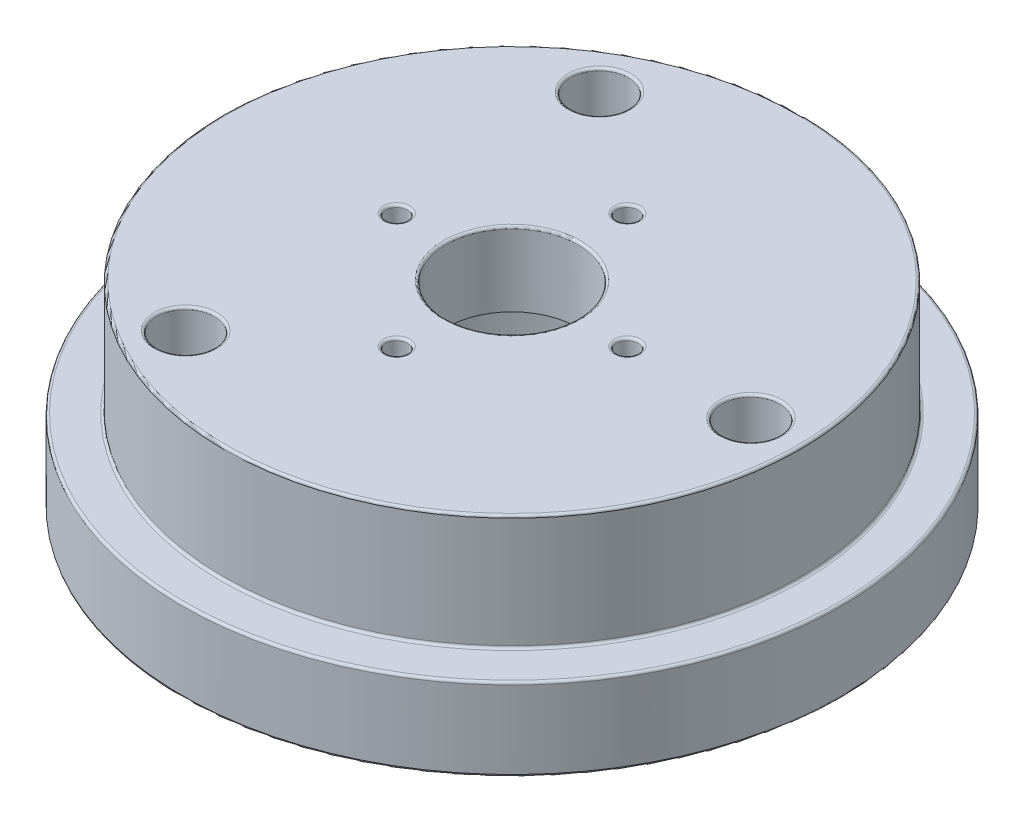
ISO-10303-21;
HEADER;
FILE_DESCRIPTION(('STEP AP214'),'2;1');
FILE_NAME('part.step','',(''),(''),'','','');
FILE_SCHEMA(('AUTOMOTIVE_DESIGN { 1 0 10303 214 1 1 1 1 }'));
ENDSEC;
DATA;
#1=APPLICATION_CONTEXT('core data for automotive mechanical design processes');
#2=APPLICATION_PROTOCOL_DEFINITION('international standard','automotive_design',2000,#1);
#3=PRODUCT_CONTEXT('',#1,'mechanical');
#4=PRODUCT('Part','Part','',(#3));
#5=PRODUCT_RELATED_PRODUCT_CATEGORY('part','',(#4));
#6=PRODUCT_DEFINITION_FORMATION('','',#4);
#7=PRODUCT_DEFINITION_CONTEXT('part definition',#1,'design');
#8=PRODUCT_DEFINITION('design','',#6,#7);
#9=PRODUCT_DEFINITION_SHAPE('','',#8);
#10=(LENGTH_UNIT() NAMED_UNIT(*) SI_UNIT(.MILLI.,.METRE.));
#11=(NAMED_UNIT(*) PLANE_ANGLE_UNIT() SI_UNIT($,.RADIAN.));
#12=(NAMED_UNIT(*) SI_UNIT($,.STERADIAN.) SOLID_ANGLE_UNIT());
#13=UNCERTAINTY_MEASURE_WITH_UNIT(LENGTH_MEASURE(1.E-05),#10,'distance_accuracy_value','');
#14=(GEOMETRIC_REPRESENTATION_CONTEXT(3) GLOBAL_UNCERTAINTY_ASSIGNED_CONTEXT((#13)) GLOBAL_UNIT_ASSIGNED_CONTEXT((#10,
#11,#12)) REPRESENTATION_CONTEXT('',''));
#15=CARTESIAN_POINT('',(0.,0.,0.));
#16=DIRECTION('',(0.,0.,1.));
#17=DIRECTION('',(1.,0.,0.));
#18=AXIS2_PLACEMENT_3D('',#15,#16,#17);
#19=CARTESIAN_POINT('',(-7.,12.,0.));
#20=DIRECTION('',(0.,-1.,0.));
#21=DIRECTION('',(1.,0.,0.));
#22=AXIS2_PLACEMENT_3D('',#19,#20,#21);
#23=CYLINDRICAL_SURFACE('',#22,0.65);
#24=CARTESIAN_POINT('',(-7.,11.85,0.));
#25=DIRECTION('',(0.,1.,0.));
#26=DIRECTION('',(-1.,0.,0.));
#27=AXIS2_PLACEMENT_3D('',#24,#25,#26);
#28=CIRCLE('',#27,0.65);
#29=CARTESIAN_POINT('',(-7.65,11.85,0.));
#30=VERTEX_POINT('',#29);
#31=EDGE_CURVE('E61',#30,#30,#28,.T.);
#32=ORIENTED_EDGE('',*,*,#31,.T.);
#33=EDGE_LOOP('',(#32));
#34=FACE_BOUND('',#33,.T.);
#35=CARTESIAN_POINT('',(-7.,7.5,0.));
#36=DIRECTION('',(0.,-1.,0.));
#37=DIRECTION('',(1.,0.,0.));
#38=AXIS2_PLACEMENT_3D('',#35,#36,#37);
#39=CIRCLE('',#38,0.65);
#40=CARTESIAN_POINT('',(-6.35,7.5,0.));
#41=VERTEX_POINT('',#40);
#42=EDGE_CURVE('E189',#41,#41,#39,.T.);
#43=ORIENTED_EDGE('',*,*,#42,.T.);
#44=EDGE_LOOP('',(#43));
#45=FACE_BOUND('',#44,.T.);
#46=ADVANCED_FACE('F37',(#34,#45),#23,.F.);
#47=CARTESIAN_POINT('',(7.,12.,0.));
#48=DIRECTION('',(0.,-1.,0.));
#49=DIRECTION('',(1.,0.,0.));
#50=AXIS2_PLACEMENT_3D('',#47,#48,#49);
#51=CYLINDRICAL_SURFACE('',#50,0.65);
#52=CARTESIAN_POINT('',(7.,11.85,0.));
#53=DIRECTION('',(0.,1.,0.));
#54=DIRECTION('',(-1.,0.,0.));
#55=AXIS2_PLACEMENT_3D('',#52,#53,#54);
#56=CIRCLE('',#55,0.65);
#57=CARTESIAN_POINT('',(6.35,11.85,0.));
#58=VERTEX_POINT('',#57);
#59=EDGE_CURVE('E55',#58,#58,#56,.T.);
#60=ORIENTED_EDGE('',*,*,#59,.T.);
#61=EDGE_LOOP('',(#60));
#62=FACE_BOUND('',#61,.T.);
#63=CARTESIAN_POINT('',(7.,7.5,0.));
#64=DIRECTION('',(0.,-1.,0.));
#65=DIRECTION('',(1.,0.,0.));
#66=AXIS2_PLACEMENT_3D('',#63,#64,#65);
#67=CIRCLE('',#66,0.65);
#68=CARTESIAN_POINT('',(7.65,7.5,0.));
#69=VERTEX_POINT('',#68);
#70=EDGE_CURVE('E181',#69,#69,#67,.T.);
#71=ORIENTED_EDGE('',*,*,#70,.T.);
#72=EDGE_LOOP('',(#71));
#73=FACE_BOUND('',#72,.T.);
#74=ADVANCED_FACE('F227',(#62,#73),#51,.F.);
#75=CARTESIAN_POINT('',(0.,12.,7.));
#76=DIRECTION('',(0.,-1.,0.));
#77=DIRECTION('',(1.,0.,0.));
#78=AXIS2_PLACEMENT_3D('',#75,#76,#77);
#79=CYLINDRICAL_SURFACE('',#78,0.65);
#80=CARTESIAN_POINT('',(0.,11.85,7.));
#81=DIRECTION('',(0.,1.,0.));
#82=DIRECTION('',(-1.,0.,0.));
#83=AXIS2_PLACEMENT_3D('',#80,#81,#82);
#84=CIRCLE('',#83,0.65);
#85=CARTESIAN_POINT('',(-0.650000000000002,11.85,7.));
#86=VERTEX_POINT('',#85);
#87=EDGE_CURVE('E50',#86,#86,#84,.T.);
#88=ORIENTED_EDGE('',*,*,#87,.T.);
#89=EDGE_LOOP('',(#88));
#90=FACE_BOUND('',#89,.T.);
#91=CARTESIAN_POINT('',(0.,7.5,7.));
#92=DIRECTION('',(0.,-1.,0.));
#93=DIRECTION('',(1.,0.,0.));
#94=AXIS2_PLACEMENT_3D('',#91,#92,#93);
#95=CIRCLE('',#94,0.65);
#96=CARTESIAN_POINT('',(0.649999999999998,7.5,7.));
#97=VERTEX_POINT('',#96);
#98=EDGE_CURVE('E193',#97,#97,#95,.T.);
#99=ORIENTED_EDGE('',*,*,#98,.T.);
#100=EDGE_LOOP('',(#99));
#101=FACE_BOUND('',#100,.T.);
#102=ADVANCED_FACE('F198',(#90,#101),#79,.F.);
#103=CARTESIAN_POINT('',(0.,12.,-7.));
#104=DIRECTION('',(0.,-1.,0.));
#105=DIRECTION('',(1.,0.,0.));
#106=AXIS2_PLACEMENT_3D('',#103,#104,#105);
#107=CYLINDRICAL_SURFACE('',#106,0.65);
#108=CARTESIAN_POINT('',(0.,11.85,-7.));
#109=DIRECTION('',(0.,1.,0.));
#110=DIRECTION('',(-1.,0.,0.));
#111=AXIS2_PLACEMENT_3D('',#108,#109,#110);
#112=CIRCLE('',#111,0.65);
#113=CARTESIAN_POINT('',(-0.649999999999999,11.85,-7.));
#114=VERTEX_POINT('',#113);
#115=EDGE_CURVE('E45',#114,#114,#112,.T.);
#116=ORIENTED_EDGE('',*,*,#115,.T.);
#117=EDGE_LOOP('',(#116));
#118=FACE_BOUND('',#117,.T.);
#119=CARTESIAN_POINT('',(0.,7.5,-7.));
#120=DIRECTION('',(0.,-1.,0.));
#121=DIRECTION('',(1.,0.,0.));
#122=AXIS2_PLACEMENT_3D('',#119,#120,#121);
#123=CIRCLE('',#122,0.65);
#124=CARTESIAN_POINT('',(0.650000000000001,7.5,-7.));
#125=VERTEX_POINT('',#124);
#126=EDGE_CURVE('E185',#125,#125,#123,.T.);
#127=ORIENTED_EDGE('',*,*,#126,.T.);
#128=EDGE_LOOP('',(#127));
#129=FACE_BOUND('',#128,.T.);
#130=ADVANCED_FACE('F238',(#118,#129),#107,.F.);
#131=CARTESIAN_POINT('',(0.,12.,0.));
#132=DIRECTION('',(0.,-1.,0.));
#133=DIRECTION('',(1.,0.,0.));
#134=AXIS2_PLACEMENT_3D('',#131,#132,#133);
#135=CYLINDRICAL_SURFACE('',#134,4.);
#136=CARTESIAN_POINT('',(0.,11.85,0.));
#137=DIRECTION('',(0.,1.,0.));
#138=DIRECTION('',(-1.,0.,0.));
#139=AXIS2_PLACEMENT_3D('',#136,#137,#138);
#140=CIRCLE('',#139,4.);
#141=CARTESIAN_POINT('',(-4.,11.85,0.));
#142=VERTEX_POINT('',#141);
#143=EDGE_CURVE('E10',#142,#142,#140,.T.);
#144=ORIENTED_EDGE('',*,*,#143,.T.);
#145=EDGE_LOOP('',(#144));
#146=FACE_BOUND('',#145,.T.);
#147=CARTESIAN_POINT('',(0.,7.5,0.));
#148=DIRECTION('',(0.,-1.,0.));
#149=DIRECTION('',(1.,0.,0.));
#150=AXIS2_PLACEMENT_3D('',#147,#148,#149);
#151=CIRCLE('',#150,4.);
#152=CARTESIAN_POINT('',(4.,7.5,0.));
#153=VERTEX_POINT('',#152);
#154=EDGE_CURVE('E177',#153,#153,#151,.T.);
#155=ORIENTED_EDGE('',*,*,#154,.T.);
#156=EDGE_LOOP('',(#155));
#157=FACE_BOUND('',#156,.T.);
#158=ADVANCED_FACE('F241',(#146,#157),#135,.F.);
#159=CARTESIAN_POINT('',(0.,0.,0.));
#160=DIRECTION('',(0.,-1.,0.));
#161=DIRECTION('',(1.,0.,0.));
#162=AXIS2_PLACEMENT_3D('',#159,#160,#161);
#163=PLANE('',#162);
#164=CARTESIAN_POINT('',(0.,0.,0.));
#165=DIRECTION('',(0.,-1.,0.));
#166=DIRECTION('',(1.,0.,0.));
#167=AXIS2_PLACEMENT_3D('',#164,#165,#166);
#168=CIRCLE('',#167,19.85);
#169=CARTESIAN_POINT('',(19.85,0.,0.));
#170=VERTEX_POINT('',#169);
#171=EDGE_CURVE('E145',#170,#170,#168,.T.);
#172=ORIENTED_EDGE('',*,*,#171,.T.);
#173=EDGE_LOOP('',(#172));
#174=FACE_BOUND('',#173,.T.);
#175=CARTESIAN_POINT('',(-7.24999999999999,0.,-12.5573683548744));
#176=DIRECTION('',(0.,-1.,0.));
#177=DIRECTION('',(1.,0.,0.));
#178=AXIS2_PLACEMENT_3D('',#175,#176,#177);
#179=CIRCLE('',#178,1.89999999999998);
#180=CARTESIAN_POINT('',(-5.35000000000002,0.,-12.5573683548744));
#181=VERTEX_POINT('',#180);
#182=EDGE_CURVE('E149',#181,#181,#179,.F.);
#183=ORIENTED_EDGE('',*,*,#182,.T.);
#184=EDGE_LOOP('',(#183));
#185=FACE_BOUND('',#184,.T.);
#186=CARTESIAN_POINT('',(14.5,0.,0.));
#187=DIRECTION('',(0.,-1.,0.));
#188=DIRECTION('',(1.,0.,0.));
#189=AXIS2_PLACEMENT_3D('',#186,#187,#188);
#190=CIRCLE('',#189,1.9);
#191=CARTESIAN_POINT('',(16.4,0.,0.));
#192=VERTEX_POINT('',#191);
#193=EDGE_CURVE('E153',#192,#192,#190,.F.);
#194=ORIENTED_EDGE('',*,*,#193,.T.);
#195=EDGE_LOOP('',(#194));
#196=FACE_BOUND('',#195,.T.);
#197=CARTESIAN_POINT('',(-7.25,0.,12.5573683548744));
#198=DIRECTION('',(0.,-1.,0.));
#199=DIRECTION('',(1.,0.,0.));
#200=AXIS2_PLACEMENT_3D('',#197,#198,#199);
#201=CIRCLE('',#200,1.89999999999996);
#202=CARTESIAN_POINT('',(-5.35000000000004,0.,12.5573683548744));
#203=VERTEX_POINT('',#202);
#204=EDGE_CURVE('E157',#203,#203,#201,.F.);
#205=ORIENTED_EDGE('',*,*,#204,.T.);
#206=EDGE_LOOP('',(#205));
#207=FACE_BOUND('',#206,.T.);
#208=CARTESIAN_POINT('',(0.,0.,0.));
#209=DIRECTION('',(0.,-1.,0.));
#210=DIRECTION('',(1.,0.,0.));
#211=AXIS2_PLACEMENT_3D('',#208,#209,#210);
#212=CIRCLE('',#211,10.15);
#213=CARTESIAN_POINT('',(10.15,0.,0.));
#214=VERTEX_POINT('',#213);
#215=EDGE_CURVE('E161',#214,#214,#212,.F.);
#216=ORIENTED_EDGE('',*,*,#215,.T.);
#217=EDGE_LOOP('',(#216));
#218=FACE_BOUND('',#217,.T.);
#219=ADVANCED_FACE('F261',(#174,#185,#196,#207,#218),#163,.T.);
#220=CARTESIAN_POINT('',(0.,12.,0.));
#221=DIRECTION('',(0.,1.,0.));
#222=DIRECTION('',(-1.,0.,0.));
#223=AXIS2_PLACEMENT_3D('',#220,#221,#222);
#224=CYLINDRICAL_SURFACE('',#223,20.);
#225=CARTESIAN_POINT('',(0.,0.149999999999999,0.));
#226=DIRECTION('',(0.,-1.,0.));
#227=DIRECTION('',(1.,0.,0.));
#228=AXIS2_PLACEMENT_3D('',#225,#226,#227);
#229=CIRCLE('',#228,20.);
#230=CARTESIAN_POINT('',(20.,0.149999999999999,0.));
#231=VERTEX_POINT('',#230);
#232=EDGE_CURVE('E165',#231,#231,#229,.F.);
#233=ORIENTED_EDGE('',*,*,#232,.T.);
#234=EDGE_LOOP('',(#233));
#235=FACE_BOUND('',#234,.T.);
#236=CARTESIAN_POINT('',(0.,4.85,0.));
#237=DIRECTION('',(0.,1.,0.));
#238=DIRECTION('',(-1.,0.,0.));
#239=AXIS2_PLACEMENT_3D('',#236,#237,#238);
#240=CIRCLE('',#239,20.);
#241=CARTESIAN_POINT('',(-20.,4.85,0.));
#242=VERTEX_POINT('',#241);
#243=EDGE_CURVE('E169',#242,#242,#240,.F.);
#244=ORIENTED_EDGE('',*,*,#243,.T.);
#245=EDGE_LOOP('',(#244));
#246=FACE_BOUND('',#245,.T.);
#247=ADVANCED_FACE('F257',(#235,#246),#224,.T.);
#248=CARTESIAN_POINT('',(-20.,5.,0.));
#249=DIRECTION('',(0.,1.,0.));
#250=DIRECTION('',(-1.,0.,0.));
#251=AXIS2_PLACEMENT_3D('',#248,#249,#250);
#252=PLANE('',#251);
#253=CARTESIAN_POINT('',(0.,5.,0.));
#254=DIRECTION('',(0.,1.,0.));
#255=DIRECTION('',(-1.,0.,0.));
#256=AXIS2_PLACEMENT_3D('',#253,#254,#255);
#257=CIRCLE('',#256,17.65);
#258=CARTESIAN_POINT('',(-17.65,5.,0.));
#259=VERTEX_POINT('',#258);
#260=EDGE_CURVE('E101',#259,#259,#257,.F.);
#261=ORIENTED_EDGE('',*,*,#260,.T.);
#262=EDGE_LOOP('',(#261));
#263=FACE_BOUND('',#262,.T.);
#264=CARTESIAN_POINT('',(0.,5.,0.));
#265=DIRECTION('',(0.,1.,0.));
#266=DIRECTION('',(-1.,0.,0.));
#267=AXIS2_PLACEMENT_3D('',#264,#265,#266);
#268=CIRCLE('',#267,19.85);
#269=CARTESIAN_POINT('',(-19.85,5.,0.));
#270=VERTEX_POINT('',#269);
#271=EDGE_CURVE('E105',#270,#270,#268,.T.);
#272=ORIENTED_EDGE('',*,*,#271,.T.);
#273=EDGE_LOOP('',(#272));
#274=FACE_BOUND('',#273,.T.);
#275=ADVANCED_FACE('F253',(#263,#274),#252,.T.);
#276=CARTESIAN_POINT('',(0.,12.,0.));
#277=DIRECTION('',(0.,1.,0.));
#278=DIRECTION('',(-1.,0.,0.));
#279=AXIS2_PLACEMENT_3D('',#276,#277,#278);
#280=CYLINDRICAL_SURFACE('',#279,17.5);
#281=CARTESIAN_POINT('',(0.,5.15,0.));
#282=DIRECTION('',(0.,1.,0.));
#283=DIRECTION('',(-1.,0.,0.));
#284=AXIS2_PLACEMENT_3D('',#281,#282,#283);
#285=CIRCLE('',#284,17.5);
#286=CARTESIAN_POINT('',(-17.5,5.15,0.));
#287=VERTEX_POINT('',#286);
#288=EDGE_CURVE('E109',#287,#287,#285,.T.);
#289=ORIENTED_EDGE('',*,*,#288,.T.);
#290=EDGE_LOOP('',(#289));
#291=FACE_BOUND('',#290,.T.);
#292=CARTESIAN_POINT('',(0.,11.85,0.));
#293=DIRECTION('',(0.,1.,0.));
#294=DIRECTION('',(-1.,0.,0.));
#295=AXIS2_PLACEMENT_3D('',#292,#293,#294);
#296=CIRCLE('',#295,17.5);
#297=CARTESIAN_POINT('',(-17.5,11.85,0.));
#298=VERTEX_POINT('',#297);
#299=EDGE_CURVE('E113',#298,#298,#296,.F.);
#300=ORIENTED_EDGE('',*,*,#299,.T.);
#301=EDGE_LOOP('',(#300));
#302=FACE_BOUND('',#301,.T.);
#303=ADVANCED_FACE('F249',(#291,#302),#280,.T.);
#304=CARTESIAN_POINT('',(-17.5,12.,0.));
#305=DIRECTION('',(0.,1.,0.));
#306=DIRECTION('',(-1.,0.,0.));
#307=AXIS2_PLACEMENT_3D('',#304,#305,#306);
#308=PLANE('',#307);
#309=CARTESIAN_POINT('',(0.,12.,0.));
#310=DIRECTION('',(0.,1.,0.));
#311=DIRECTION('',(-1.,0.,0.));
#312=AXIS2_PLACEMENT_3D('',#309,#310,#311);
#313=CIRCLE('',#312,17.35);
#314=CARTESIAN_POINT('',(-17.35,12.,0.));
#315=VERTEX_POINT('',#314);
#316=EDGE_CURVE('E65',#315,#315,#313,.T.);
#317=ORIENTED_EDGE('',*,*,#316,.T.);
#318=EDGE_LOOP('',(#317));
#319=FACE_BOUND('',#318,.T.);
#320=CARTESIAN_POINT('',(-7.,12.,0.));
#321=DIRECTION('',(0.,1.,0.));
#322=DIRECTION('',(-1.,0.,0.));
#323=AXIS2_PLACEMENT_3D('',#320,#321,#322);
#324=CIRCLE('',#323,0.8);
#325=CARTESIAN_POINT('',(-7.8,12.,0.));
#326=VERTEX_POINT('',#325);
#327=EDGE_CURVE('E69',#326,#326,#324,.F.);
#328=ORIENTED_EDGE('',*,*,#327,.T.);
#329=EDGE_LOOP('',(#328));
#330=FACE_BOUND('',#329,.T.);
#331=CARTESIAN_POINT('',(7.,12.,0.));
#332=DIRECTION('',(0.,1.,0.));
#333=DIRECTION('',(-1.,0.,0.));
#334=AXIS2_PLACEMENT_3D('',#331,#332,#333);
#335=CIRCLE('',#334,0.8);
#336=CARTESIAN_POINT('',(6.2,12.,0.));
#337=VERTEX_POINT('',#336);
#338=EDGE_CURVE('E73',#337,#337,#335,.F.);
#339=ORIENTED_EDGE('',*,*,#338,.T.);
#340=EDGE_LOOP('',(#339));
#341=FACE_BOUND('',#340,.T.);
#342=CARTESIAN_POINT('',(0.,12.,7.));
#343=DIRECTION('',(0.,1.,0.));
#344=DIRECTION('',(-1.,0.,0.));
#345=AXIS2_PLACEMENT_3D('',#342,#343,#344);
#346=CIRCLE('',#345,0.8);
#347=CARTESIAN_POINT('',(-0.800000000000002,12.,7.));
#348=VERTEX_POINT('',#347);
#349=EDGE_CURVE('E77',#348,#348,#346,.F.);
#350=ORIENTED_EDGE('',*,*,#349,.T.);
#351=EDGE_LOOP('',(#350));
#352=FACE_BOUND('',#351,.T.);
#353=CARTESIAN_POINT('',(0.,12.,-7.));
#354=DIRECTION('',(0.,1.,0.));
#355=DIRECTION('',(-1.,0.,0.));
#356=AXIS2_PLACEMENT_3D('',#353,#354,#355);
#357=CIRCLE('',#356,0.8);
#358=CARTESIAN_POINT('',(-0.799999999999999,12.,-7.));
#359=VERTEX_POINT('',#358);
#360=EDGE_CURVE('E81',#359,#359,#357,.F.);
#361=ORIENTED_EDGE('',*,*,#360,.T.);
#362=EDGE_LOOP('',(#361));
#363=FACE_BOUND('',#362,.T.);
#364=CARTESIAN_POINT('',(0.,12.,0.));
#365=DIRECTION('',(0.,1.,0.));
#366=DIRECTION('',(-1.,0.,0.));
#367=AXIS2_PLACEMENT_3D('',#364,#365,#366);
#368=CIRCLE('',#367,4.15);
#369=CARTESIAN_POINT('',(-4.15,12.,0.));
#370=VERTEX_POINT('',#369);
#371=EDGE_CURVE('E85',#370,#370,#368,.F.);
#372=ORIENTED_EDGE('',*,*,#371,.T.);
#373=EDGE_LOOP('',(#372));
#374=FACE_BOUND('',#373,.T.);
#375=CARTESIAN_POINT('',(-7.24999999999999,12.,-12.5573683548744));
#376=DIRECTION('',(0.,1.,0.));
#377=DIRECTION('',(-1.,0.,0.));
#378=AXIS2_PLACEMENT_3D('',#375,#376,#377);
#379=CIRCLE('',#378,1.89999999999998);
#380=CARTESIAN_POINT('',(-9.14999999999997,12.,-12.5573683548744));
#381=VERTEX_POINT('',#380);
#382=EDGE_CURVE('E89',#381,#381,#379,.F.);
#383=ORIENTED_EDGE('',*,*,#382,.T.);
#384=EDGE_LOOP('',(#383));
#385=FACE_BOUND('',#384,.T.);
#386=CARTESIAN_POINT('',(14.5,12.,0.));
#387=DIRECTION('',(0.,1.,0.));
#388=DIRECTION('',(-1.,0.,0.));
#389=AXIS2_PLACEMENT_3D('',#386,#387,#388);
#390=CIRCLE('',#389,1.9);
#391=CARTESIAN_POINT('',(12.6,12.,0.));
#392=VERTEX_POINT('',#391);
#393=EDGE_CURVE('E93',#392,#392,#390,.F.);
#394=ORIENTED_EDGE('',*,*,#393,.T.);
#395=EDGE_LOOP('',(#394));
#396=FACE_BOUND('',#395,.T.);
#397=CARTESIAN_POINT('',(-7.25,12.,12.5573683548744));
#398=DIRECTION('',(0.,1.,0.));
#399=DIRECTION('',(-1.,0.,0.));
#400=AXIS2_PLACEMENT_3D('',#397,#398,#399);
#401=CIRCLE('',#400,1.89999999999996);
#402=CARTESIAN_POINT('',(-9.14999999999996,12.,12.5573683548744));
#403=VERTEX_POINT('',#402);
#404=EDGE_CURVE('E97',#403,#403,#401,.F.);
#405=ORIENTED_EDGE('',*,*,#404,.T.);
#406=EDGE_LOOP('',(#405));
#407=FACE_BOUND('',#406,.T.);
#408=ADVANCED_FACE('F245',(#319,#330,#341,#352,#363,#374,#385,#396,#407),#308,.T.);
#409=CARTESIAN_POINT('',(-7.24999999999999,12.,-12.5573683548744));
#410=DIRECTION('',(0.,-1.,0.));
#411=DIRECTION('',(1.,0.,0.));
#412=AXIS2_PLACEMENT_3D('',#409,#410,#411);
#413=CYLINDRICAL_SURFACE('',#412,1.74999999999998);
#414=CARTESIAN_POINT('',(-7.24999999999999,0.149999999999999,-12.5573683548744));
#415=DIRECTION('',(0.,-1.,0.));
#416=DIRECTION('',(1.,0.,0.));
#417=AXIS2_PLACEMENT_3D('',#414,#415,#416);
#418=CIRCLE('',#417,1.74999999999998);
#419=CARTESIAN_POINT('',(-5.50000000000002,0.149999999999999,-12.5573683548744));
#420=VERTEX_POINT('',#419);
#421=EDGE_CURVE('E137',#420,#420,#418,.T.);
#422=ORIENTED_EDGE('',*,*,#421,.T.);
#423=EDGE_LOOP('',(#422));
#424=FACE_BOUND('',#423,.T.);
#425=CARTESIAN_POINT('',(-7.24999999999999,11.85,-12.5573683548744));
#426=DIRECTION('',(0.,1.,0.));
#427=DIRECTION('',(-1.,0.,0.));
#428=AXIS2_PLACEMENT_3D('',#425,#426,#427);
#429=CIRCLE('',#428,1.74999999999998);
#430=CARTESIAN_POINT('',(-8.99999999999997,11.85,-12.5573683548744));
#431=VERTEX_POINT('',#430);
#432=EDGE_CURVE('E141',#431,#431,#429,.T.);
#433=ORIENTED_EDGE('',*,*,#432,.T.);
#434=EDGE_LOOP('',(#433));
#435=FACE_BOUND('',#434,.T.);
#436=ADVANCED_FACE('F248',(#424,#435),#413,.F.);
#437=CARTESIAN_POINT('',(14.5,12.,0.));
#438=DIRECTION('',(0.,-1.,0.));
#439=DIRECTION('',(1.,0.,0.));
#440=AXIS2_PLACEMENT_3D('',#437,#438,#439);
#441=CYLINDRICAL_SURFACE('',#440,1.75);
#442=CARTESIAN_POINT('',(14.5,0.149999999999999,0.));
#443=DIRECTION('',(0.,-1.,0.));
#444=DIRECTION('',(1.,0.,0.));
#445=AXIS2_PLACEMENT_3D('',#442,#443,#444);
#446=CIRCLE('',#445,1.75);
#447=CARTESIAN_POINT('',(16.25,0.149999999999999,0.));
#448=VERTEX_POINT('',#447);
#449=EDGE_CURVE('E129',#448,#448,#446,.T.);
#450=ORIENTED_EDGE('',*,*,#449,.T.);
#451=EDGE_LOOP('',(#450));
#452=FACE_BOUND('',#451,.T.);
#453=CARTESIAN_POINT('',(14.5,11.85,0.));
#454=DIRECTION('',(0.,1.,0.));
#455=DIRECTION('',(-1.,0.,0.));
#456=AXIS2_PLACEMENT_3D('',#453,#454,#455);
#457=CIRCLE('',#456,1.75);
#458=CARTESIAN_POINT('',(12.75,11.85,0.));
#459=VERTEX_POINT('',#458);
#460=EDGE_CURVE('E133',#459,#459,#457,.T.);
#461=ORIENTED_EDGE('',*,*,#460,.T.);
#462=EDGE_LOOP('',(#461));
#463=FACE_BOUND('',#462,.T.);
#464=ADVANCED_FACE('F223',(#452,#463),#441,.F.);
#465=CARTESIAN_POINT('',(-7.25,12.,12.5573683548744));
#466=DIRECTION('',(0.,-1.,0.));
#467=DIRECTION('',(1.,0.,0.));
#468=AXIS2_PLACEMENT_3D('',#465,#466,#467);
#469=CYLINDRICAL_SURFACE('',#468,1.74999999999996);
#470=CARTESIAN_POINT('',(-7.25,0.149999999999999,12.5573683548744));
#471=DIRECTION('',(0.,-1.,0.));
#472=DIRECTION('',(1.,0.,0.));
#473=AXIS2_PLACEMENT_3D('',#470,#471,#472);
#474=CIRCLE('',#473,1.74999999999996);
#475=CARTESIAN_POINT('',(-5.50000000000004,0.149999999999999,12.5573683548744));
#476=VERTEX_POINT('',#475);
#477=EDGE_CURVE('E121',#476,#476,#474,.T.);
#478=ORIENTED_EDGE('',*,*,#477,.T.);
#479=EDGE_LOOP('',(#478));
#480=FACE_BOUND('',#479,.T.);
#481=CARTESIAN_POINT('',(-7.25,11.85,12.5573683548744));
#482=DIRECTION('',(0.,1.,0.));
#483=DIRECTION('',(-1.,0.,0.));
#484=AXIS2_PLACEMENT_3D('',#481,#482,#483);
#485=CIRCLE('',#484,1.74999999999996);
#486=CARTESIAN_POINT('',(-8.99999999999996,11.85,12.5573683548744));
#487=VERTEX_POINT('',#486);
#488=EDGE_CURVE('E125',#487,#487,#485,.T.);
#489=ORIENTED_EDGE('',*,*,#488,.T.);
#490=EDGE_LOOP('',(#489));
#491=FACE_BOUND('',#490,.T.);
#492=ADVANCED_FACE('F217',(#480,#491),#469,.F.);
#493=CARTESIAN_POINT('',(0.,7.5,0.));
#494=DIRECTION('',(0.,-1.,0.));
#495=DIRECTION('',(1.,0.,0.));
#496=AXIS2_PLACEMENT_3D('',#493,#494,#495);
#497=CYLINDRICAL_SURFACE('',#496,10.);
#498=CARTESIAN_POINT('',(0.,0.15,0.));
#499=DIRECTION('',(0.,-1.,0.));
#500=DIRECTION('',(1.,0.,0.));
#501=AXIS2_PLACEMENT_3D('',#498,#499,#500);
#502=CIRCLE('',#501,10.);
#503=CARTESIAN_POINT('',(10.,0.15,0.));
#504=VERTEX_POINT('',#503);
#505=EDGE_CURVE('E117',#504,#504,#502,.T.);
#506=ORIENTED_EDGE('',*,*,#505,.T.);
#507=EDGE_LOOP('',(#506));
#508=FACE_BOUND('',#507,.T.);
#509=CARTESIAN_POINT('',(0.,7.5,0.));
#510=DIRECTION('',(0.,-1.,0.));
#511=DIRECTION('',(1.,0.,0.));
#512=AXIS2_PLACEMENT_3D('',#509,#510,#511);
#513=CIRCLE('',#512,10.);
#514=CARTESIAN_POINT('',(10.,7.5,0.));
#515=VERTEX_POINT('',#514);
#516=EDGE_CURVE('E173',#515,#515,#513,.T.);
#517=ORIENTED_EDGE('',*,*,#516,.F.);
#518=EDGE_LOOP('',(#517));
#519=FACE_BOUND('',#518,.T.);
#520=ADVANCED_FACE('F204',(#508,#519),#497,.F.);
#521=CARTESIAN_POINT('',(0.,7.5,0.));
#522=DIRECTION('',(0.,-1.,0.));
#523=DIRECTION('',(1.,0.,0.));
#524=AXIS2_PLACEMENT_3D('',#521,#522,#523);
#525=PLANE('',#524);
#526=ORIENTED_EDGE('',*,*,#98,.F.);
#527=EDGE_LOOP('',(#526));
#528=FACE_BOUND('',#527,.T.);
#529=ORIENTED_EDGE('',*,*,#42,.F.);
#530=EDGE_LOOP('',(#529));
#531=FACE_BOUND('',#530,.T.);
#532=ORIENTED_EDGE('',*,*,#126,.F.);
#533=EDGE_LOOP('',(#532));
#534=FACE_BOUND('',#533,.T.);
#535=ORIENTED_EDGE('',*,*,#70,.F.);
#536=EDGE_LOOP('',(#535));
#537=FACE_BOUND('',#536,.T.);
#538=ORIENTED_EDGE('',*,*,#154,.F.);
#539=EDGE_LOOP('',(#538));
#540=FACE_BOUND('',#539,.T.);
#541=ORIENTED_EDGE('',*,*,#516,.T.);
#542=EDGE_LOOP('',(#541));
#543=FACE_BOUND('',#542,.T.);
#544=ADVANCED_FACE('F200',(#528,#531,#534,#537,#540,#543),#525,.T.);
#545=CARTESIAN_POINT('',(0.,0.149999999999999,0.));
#546=DIRECTION('',(0.,-1.,0.));
#547=DIRECTION('',(1.,0.,0.));
#548=AXIS2_PLACEMENT_3D('',#545,#546,#547);
#549=TOROIDAL_SURFACE('',#548,19.85,0.15);
#550=ORIENTED_EDGE('',*,*,#171,.F.);
#551=EDGE_LOOP('',(#550));
#552=FACE_BOUND('',#551,.T.);
#553=ORIENTED_EDGE('',*,*,#232,.F.);
#554=EDGE_LOOP('',(#553));
#555=FACE_BOUND('',#554,.T.);
#556=ADVANCED_FACE('F203',(#552,#555),#549,.T.);
#557=CARTESIAN_POINT('',(-7.24999999999999,0.149999999999999,-12.5573683548744));
#558=DIRECTION('',(0.,-1.,0.));
#559=DIRECTION('',(1.,0.,0.));
#560=AXIS2_PLACEMENT_3D('',#557,#558,#559);
#561=TOROIDAL_SURFACE('',#560,1.89999999999998,0.15);
#562=ORIENTED_EDGE('',*,*,#182,.F.);
#563=EDGE_LOOP('',(#562));
#564=FACE_BOUND('',#563,.T.);
#565=ORIENTED_EDGE('',*,*,#421,.F.);
#566=EDGE_LOOP('',(#565));
#567=FACE_BOUND('',#566,.T.);
#568=ADVANCED_FACE('F268',(#564,#567),#561,.T.);
#569=CARTESIAN_POINT('',(14.5,0.149999999999999,0.));
#570=DIRECTION('',(0.,-1.,0.));
#571=DIRECTION('',(1.,0.,0.));
#572=AXIS2_PLACEMENT_3D('',#569,#570,#571);
#573=TOROIDAL_SURFACE('',#572,1.9,0.15);
#574=ORIENTED_EDGE('',*,*,#193,.F.);
#575=EDGE_LOOP('',(#574));
#576=FACE_BOUND('',#575,.T.);
#577=ORIENTED_EDGE('',*,*,#449,.F.);
#578=EDGE_LOOP('',(#577));
#579=FACE_BOUND('',#578,.T.);
#580=ADVANCED_FACE('F272',(#576,#579),#573,.T.);
#581=CARTESIAN_POINT('',(-7.25,0.149999999999999,12.5573683548744));
#582=DIRECTION('',(0.,-1.,0.));
#583=DIRECTION('',(1.,0.,0.));
#584=AXIS2_PLACEMENT_3D('',#581,#582,#583);
#585=TOROIDAL_SURFACE('',#584,1.89999999999996,0.15);
#586=ORIENTED_EDGE('',*,*,#204,.F.);
#587=EDGE_LOOP('',(#586));
#588=FACE_BOUND('',#587,.T.);
#589=ORIENTED_EDGE('',*,*,#477,.F.);
#590=EDGE_LOOP('',(#589));
#591=FACE_BOUND('',#590,.T.);
#592=ADVANCED_FACE('F276',(#588,#591),#585,.T.);
#593=CARTESIAN_POINT('',(0.,0.15,0.));
#594=DIRECTION('',(0.,-1.,0.));
#595=DIRECTION('',(1.,0.,0.));
#596=AXIS2_PLACEMENT_3D('',#593,#594,#595);
#597=TOROIDAL_SURFACE('',#596,10.15,0.15);
#598=ORIENTED_EDGE('',*,*,#215,.F.);
#599=EDGE_LOOP('',(#598));
#600=FACE_BOUND('',#599,.T.);
#601=ORIENTED_EDGE('',*,*,#505,.F.);
#602=EDGE_LOOP('',(#601));
#603=FACE_BOUND('',#602,.T.);
#604=ADVANCED_FACE('F280',(#600,#603),#597,.T.);
#605=CARTESIAN_POINT('',(0.,5.15,0.));
#606=DIRECTION('',(0.,1.,0.));
#607=DIRECTION('',(-1.,0.,0.));
#608=AXIS2_PLACEMENT_3D('',#605,#606,#607);
#609=TOROIDAL_SURFACE('',#608,17.65,0.15);
#610=ORIENTED_EDGE('',*,*,#260,.F.);
#611=EDGE_LOOP('',(#610));
#612=FACE_BOUND('',#611,.T.);
#613=ORIENTED_EDGE('',*,*,#288,.F.);
#614=EDGE_LOOP('',(#613));
#615=FACE_BOUND('',#614,.T.);
#616=ADVANCED_FACE('F284',(#612,#615),#609,.F.);
#617=CARTESIAN_POINT('',(0.,4.85,0.));
#618=DIRECTION('',(0.,1.,0.));
#619=DIRECTION('',(-1.,0.,0.));
#620=AXIS2_PLACEMENT_3D('',#617,#618,#619);
#621=TOROIDAL_SURFACE('',#620,19.85,0.15);
#622=ORIENTED_EDGE('',*,*,#243,.F.);
#623=EDGE_LOOP('',(#622));
#624=FACE_BOUND('',#623,.T.);
#625=ORIENTED_EDGE('',*,*,#271,.F.);
#626=EDGE_LOOP('',(#625));
#627=FACE_BOUND('',#626,.T.);
#628=ADVANCED_FACE('F288',(#624,#627),#621,.T.);
#629=CARTESIAN_POINT('',(0.,11.85,0.));
#630=DIRECTION('',(0.,1.,0.));
#631=DIRECTION('',(-1.,0.,0.));
#632=AXIS2_PLACEMENT_3D('',#629,#630,#631);
#633=TOROIDAL_SURFACE('',#632,17.35,0.15);
#634=ORIENTED_EDGE('',*,*,#299,.F.);
#635=EDGE_LOOP('',(#634));
#636=FACE_BOUND('',#635,.T.);
#637=ORIENTED_EDGE('',*,*,#316,.F.);
#638=EDGE_LOOP('',(#637));
#639=FACE_BOUND('',#638,.T.);
#640=ADVANCED_FACE('F292',(#636,#639),#633,.T.);
#641=CARTESIAN_POINT('',(-7.,11.85,0.));
#642=DIRECTION('',(0.,1.,0.));
#643=DIRECTION('',(-1.,0.,0.));
#644=AXIS2_PLACEMENT_3D('',#641,#642,#643);
#645=TOROIDAL_SURFACE('',#644,0.8,0.15);
#646=ORIENTED_EDGE('',*,*,#31,.F.);
#647=EDGE_LOOP('',(#646));
#648=FACE_BOUND('',#647,.T.);
#649=ORIENTED_EDGE('',*,*,#327,.F.);
#650=EDGE_LOOP('',(#649));
#651=FACE_BOUND('',#650,.T.);
#652=ADVANCED_FACE('F296',(#648,#651),#645,.T.);
#653=CARTESIAN_POINT('',(7.,11.85,0.));
#654=DIRECTION('',(0.,1.,0.));
#655=DIRECTION('',(-1.,0.,0.));
#656=AXIS2_PLACEMENT_3D('',#653,#654,#655);
#657=TOROIDAL_SURFACE('',#656,0.8,0.15);
#658=ORIENTED_EDGE('',*,*,#59,.F.);
#659=EDGE_LOOP('',(#658));
#660=FACE_BOUND('',#659,.T.);
#661=ORIENTED_EDGE('',*,*,#338,.F.);
#662=EDGE_LOOP('',(#661));
#663=FACE_BOUND('',#662,.T.);
#664=ADVANCED_FACE('F300',(#660,#663),#657,.T.);
#665=CARTESIAN_POINT('',(0.,11.85,7.));
#666=DIRECTION('',(0.,1.,0.));
#667=DIRECTION('',(-1.,0.,0.));
#668=AXIS2_PLACEMENT_3D('',#665,#666,#667);
#669=TOROIDAL_SURFACE('',#668,0.8,0.15);
#670=ORIENTED_EDGE('',*,*,#87,.F.);
#671=EDGE_LOOP('',(#670));
#672=FACE_BOUND('',#671,.T.);
#673=ORIENTED_EDGE('',*,*,#349,.F.);
#674=EDGE_LOOP('',(#673));
#675=FACE_BOUND('',#674,.T.);
#676=ADVANCED_FACE('F304',(#672,#675),#669,.T.);
#677=CARTESIAN_POINT('',(0.,11.85,-7.));
#678=DIRECTION('',(0.,1.,0.));
#679=DIRECTION('',(-1.,0.,0.));
#680=AXIS2_PLACEMENT_3D('',#677,#678,#679);
#681=TOROIDAL_SURFACE('',#680,0.8,0.15);
#682=ORIENTED_EDGE('',*,*,#115,.F.);
#683=EDGE_LOOP('',(#682));
#684=FACE_BOUND('',#683,.T.);
#685=ORIENTED_EDGE('',*,*,#360,.F.);
#686=EDGE_LOOP('',(#685));
#687=FACE_BOUND('',#686,.T.);
#688=ADVANCED_FACE('F308',(#684,#687),#681,.T.);
#689=CARTESIAN_POINT('',(0.,11.85,0.));
#690=DIRECTION('',(0.,1.,0.));
#691=DIRECTION('',(-1.,0.,0.));
#692=AXIS2_PLACEMENT_3D('',#689,#690,#691);
#693=TOROIDAL_SURFACE('',#692,4.15,0.15);
#694=ORIENTED_EDGE('',*,*,#143,.F.);
#695=EDGE_LOOP('',(#694));
#696=FACE_BOUND('',#695,.T.);
#697=ORIENTED_EDGE('',*,*,#371,.F.);
#698=EDGE_LOOP('',(#697));
#699=FACE_BOUND('',#698,.T.);
#700=ADVANCED_FACE('F312',(#696,#699),#693,.T.);
#701=CARTESIAN_POINT('',(-7.24999999999999,11.85,-12.5573683548744));
#702=DIRECTION('',(0.,1.,0.));
#703=DIRECTION('',(-1.,0.,0.));
#704=AXIS2_PLACEMENT_3D('',#701,#702,#703);
#705=TOROIDAL_SURFACE('',#704,1.89999999999998,0.15);
#706=ORIENTED_EDGE('',*,*,#432,.F.);
#707=EDGE_LOOP('',(#706));
#708=FACE_BOUND('',#707,.T.);
#709=ORIENTED_EDGE('',*,*,#382,.F.);
#710=EDGE_LOOP('',(#709));
#711=FACE_BOUND('',#710,.T.);
#712=ADVANCED_FACE('F316',(#708,#711),#705,.T.);
#713=CARTESIAN_POINT('',(14.5,11.85,0.));
#714=DIRECTION('',(0.,1.,0.));
#715=DIRECTION('',(-1.,0.,0.));
#716=AXIS2_PLACEMENT_3D('',#713,#714,#715);
#717=TOROIDAL_SURFACE('',#716,1.9,0.15);
#718=ORIENTED_EDGE('',*,*,#460,.F.);
#719=EDGE_LOOP('',(#718));
#720=FACE_BOUND('',#719,.T.);
#721=ORIENTED_EDGE('',*,*,#393,.F.);
#722=EDGE_LOOP('',(#721));
#723=FACE_BOUND('',#722,.T.);
#724=ADVANCED_FACE('F319',(#720,#723),#717,.T.);
#725=CARTESIAN_POINT('',(-7.25,11.85,12.5573683548744));
#726=DIRECTION('',(0.,1.,0.));
#727=DIRECTION('',(-1.,0.,0.));
#728=AXIS2_PLACEMENT_3D('',#725,#726,#727);
#729=TOROIDAL_SURFACE('',#728,1.89999999999996,0.15);
#730=ORIENTED_EDGE('',*,*,#488,.F.);
#731=EDGE_LOOP('',(#730));
#732=FACE_BOUND('',#731,.T.);
#733=ORIENTED_EDGE('',*,*,#404,.F.);
#734=EDGE_LOOP('',(#733));
#735=FACE_BOUND('',#734,.T.);
#736=ADVANCED_FACE('F39',(#732,#735),#729,.T.);
#737=CLOSED_SHELL('',(#46,#74,#102,#130,#158,#219,#247,#275,#303,#408,#436,#464,#492,#520,#544,
#556,#568,#580,#592,#604,#616,#628,#640,#652,#664,#676,#688,#700,#712,#724,#736));
#738=MANIFOLD_SOLID_BREP('B2',#737);
#739=ADVANCED_BREP_SHAPE_REPRESENTATION('',(#18,#738),#14);
#740=SHAPE_DEFINITION_REPRESENTATION(#9,#739);
ENDSEC;
END-ISO-10303-21;
